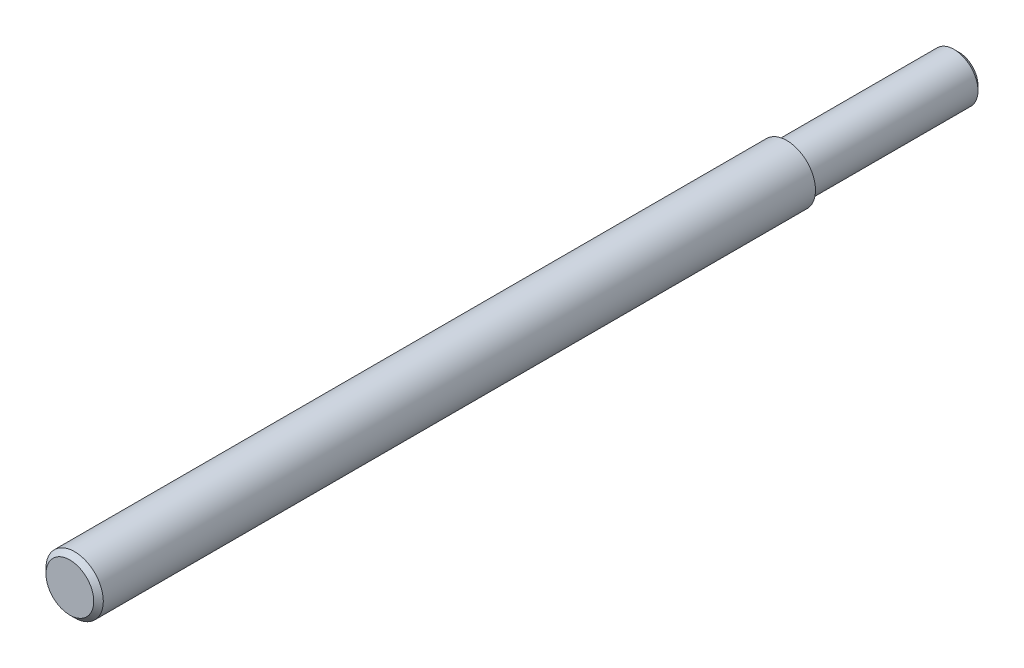
ISO-10303-21;
HEADER;
FILE_DESCRIPTION(('STEP AP214'),'2;1');
FILE_NAME('part.step','',(''),(''),'','','');
FILE_SCHEMA(('AUTOMOTIVE_DESIGN { 1 0 10303 214 1 1 1 1 }'));
ENDSEC;
DATA;
#1=APPLICATION_CONTEXT('core data for automotive mechanical design processes');
#2=APPLICATION_PROTOCOL_DEFINITION('international standard','automotive_design',2000,#1);
#3=PRODUCT_CONTEXT('',#1,'mechanical');
#4=PRODUCT('Part','Part','',(#3));
#5=PRODUCT_RELATED_PRODUCT_CATEGORY('part','',(#4));
#6=PRODUCT_DEFINITION_FORMATION('','',#4);
#7=PRODUCT_DEFINITION_CONTEXT('part definition',#1,'design');
#8=PRODUCT_DEFINITION('design','',#6,#7);
#9=PRODUCT_DEFINITION_SHAPE('','',#8);
#10=(LENGTH_UNIT() NAMED_UNIT(*) SI_UNIT(.MILLI.,.METRE.));
#11=(NAMED_UNIT(*) PLANE_ANGLE_UNIT() SI_UNIT($,.RADIAN.));
#12=(NAMED_UNIT(*) SI_UNIT($,.STERADIAN.) SOLID_ANGLE_UNIT());
#13=UNCERTAINTY_MEASURE_WITH_UNIT(LENGTH_MEASURE(1.E-05),#10,'distance_accuracy_value','');
#14=(GEOMETRIC_REPRESENTATION_CONTEXT(3) GLOBAL_UNCERTAINTY_ASSIGNED_CONTEXT((#13)) GLOBAL_UNIT_ASSIGNED_CONTEXT((#10,
#11,#12)) REPRESENTATION_CONTEXT('',''));
#15=CARTESIAN_POINT('',(0.,0.,0.));
#16=DIRECTION('',(0.,0.,1.));
#17=DIRECTION('',(1.,0.,0.));
#18=AXIS2_PLACEMENT_3D('',#15,#16,#17);
#19=CARTESIAN_POINT('',(0.,0.,36.));
#20=DIRECTION('',(0.,0.,-1.));
#21=DIRECTION('',(-1.,0.,0.));
#22=AXIS2_PLACEMENT_3D('',#19,#20,#21);
#23=CYLINDRICAL_SURFACE('',#22,5.);
#24=CARTESIAN_POINT('',(0.,0.,1.00000000000001));
#25=DIRECTION('',(0.,0.,1.));
#26=DIRECTION('',(1.,0.,0.));
#27=AXIS2_PLACEMENT_3D('',#24,#25,#26);
#28=CIRCLE('',#27,5.);
#29=CARTESIAN_POINT('',(5.,0.,1.00000000000001));
#30=VERTEX_POINT('',#29);
#31=EDGE_CURVE('E38',#30,#30,#28,.T.);
#32=ORIENTED_EDGE('',*,*,#31,.T.);
#33=EDGE_LOOP('',(#32));
#34=FACE_BOUND('',#33,.T.);
#35=CARTESIAN_POINT('',(0.,0.,36.));
#36=DIRECTION('',(0.,0.,1.));
#37=DIRECTION('',(1.,0.,0.));
#38=AXIS2_PLACEMENT_3D('',#35,#36,#37);
#39=CIRCLE('',#38,5.);
#40=CARTESIAN_POINT('',(5.,0.,36.));
#41=VERTEX_POINT('',#40);
#42=EDGE_CURVE('E51',#41,#41,#39,.T.);
#43=ORIENTED_EDGE('',*,*,#42,.F.);
#44=EDGE_LOOP('',(#43));
#45=FACE_BOUND('',#44,.T.);
#46=ADVANCED_FACE('F31',(#34,#45),#23,.T.);
#47=CARTESIAN_POINT('',(0.,0.,0.));
#48=DIRECTION('',(0.,0.,1.));
#49=DIRECTION('',(1.,0.,0.));
#50=AXIS2_PLACEMENT_3D('',#47,#48,#49);
#51=PLANE('',#50);
#52=CARTESIAN_POINT('',(0.,0.,0.));
#53=DIRECTION('',(0.,0.,1.));
#54=DIRECTION('',(1.,0.,0.));
#55=AXIS2_PLACEMENT_3D('',#52,#53,#54);
#56=CIRCLE('',#55,3.99999999999998);
#57=CARTESIAN_POINT('',(3.99999999999998,0.,0.));
#58=VERTEX_POINT('',#57);
#59=EDGE_CURVE('E10',#58,#58,#56,.F.);
#60=ORIENTED_EDGE('',*,*,#59,.T.);
#61=EDGE_LOOP('',(#60));
#62=FACE_BOUND('',#61,.T.);
#63=ADVANCED_FACE('F75',(#62),#51,.F.);
#64=CARTESIAN_POINT('',(0.,0.,186.));
#65=DIRECTION('',(0.,0.,-1.));
#66=DIRECTION('',(-1.,0.,0.));
#67=AXIS2_PLACEMENT_3D('',#64,#65,#66);
#68=CYLINDRICAL_SURFACE('',#67,6.);
#69=CARTESIAN_POINT('',(0.,0.,185.));
#70=DIRECTION('',(0.,0.,1.));
#71=DIRECTION('',(1.,0.,0.));
#72=AXIS2_PLACEMENT_3D('',#69,#70,#71);
#73=CIRCLE('',#72,6.);
#74=CARTESIAN_POINT('',(6.,0.,185.));
#75=VERTEX_POINT('',#74);
#76=EDGE_CURVE('E42',#75,#75,#73,.F.);
#77=ORIENTED_EDGE('',*,*,#76,.T.);
#78=EDGE_LOOP('',(#77));
#79=FACE_BOUND('',#78,.T.);
#80=CARTESIAN_POINT('',(0.,0.,36.));
#81=DIRECTION('',(0.,0.,1.));
#82=DIRECTION('',(1.,0.,0.));
#83=AXIS2_PLACEMENT_3D('',#80,#81,#82);
#84=CIRCLE('',#83,6.);
#85=CARTESIAN_POINT('',(6.,0.,36.));
#86=VERTEX_POINT('',#85);
#87=EDGE_CURVE('E54',#86,#86,#84,.T.);
#88=ORIENTED_EDGE('',*,*,#87,.T.);
#89=EDGE_LOOP('',(#88));
#90=FACE_BOUND('',#89,.T.);
#91=ADVANCED_FACE('F58',(#79,#90),#68,.T.);
#92=CARTESIAN_POINT('',(0.,0.,186.));
#93=DIRECTION('',(0.,0.,1.));
#94=DIRECTION('',(1.,0.,0.));
#95=AXIS2_PLACEMENT_3D('',#92,#93,#94);
#96=PLANE('',#95);
#97=CARTESIAN_POINT('',(0.,0.,186.));
#98=DIRECTION('',(0.,0.,1.));
#99=DIRECTION('',(1.,0.,0.));
#100=AXIS2_PLACEMENT_3D('',#97,#98,#99);
#101=CIRCLE('',#100,5.);
#102=CARTESIAN_POINT('',(5.,0.,186.));
#103=VERTEX_POINT('',#102);
#104=EDGE_CURVE('E46',#103,#103,#101,.T.);
#105=ORIENTED_EDGE('',*,*,#104,.T.);
#106=EDGE_LOOP('',(#105));
#107=FACE_BOUND('',#106,.T.);
#108=ADVANCED_FACE('F63',(#107),#96,.T.);
#109=CARTESIAN_POINT('',(0.,0.,36.));
#110=DIRECTION('',(0.,0.,1.));
#111=DIRECTION('',(1.,0.,0.));
#112=AXIS2_PLACEMENT_3D('',#109,#110,#111);
#113=PLANE('',#112);
#114=ORIENTED_EDGE('',*,*,#42,.T.);
#115=EDGE_LOOP('',(#114));
#116=FACE_BOUND('',#115,.T.);
#117=ORIENTED_EDGE('',*,*,#87,.F.);
#118=EDGE_LOOP('',(#117));
#119=FACE_BOUND('',#118,.T.);
#120=ADVANCED_FACE('F60',(#116,#119),#113,.F.);
#121=CARTESIAN_POINT('',(0.,0.,186.));
#122=DIRECTION('',(0.,0.,-1.));
#123=DIRECTION('',(-1.,0.,0.));
#124=AXIS2_PLACEMENT_3D('',#121,#122,#123);
#125=CONICAL_SURFACE('',#124,5.,0.785398163397446);
#126=ORIENTED_EDGE('',*,*,#76,.F.);
#127=EDGE_LOOP('',(#126));
#128=FACE_BOUND('',#127,.T.);
#129=ORIENTED_EDGE('',*,*,#104,.F.);
#130=EDGE_LOOP('',(#129));
#131=FACE_BOUND('',#130,.T.);
#132=ADVANCED_FACE('F62',(#128,#131),#125,.T.);
#133=CARTESIAN_POINT('',(0.,0.,1.00000000000001));
#134=DIRECTION('',(0.,0.,1.));
#135=DIRECTION('',(1.,0.,0.));
#136=AXIS2_PLACEMENT_3D('',#133,#134,#135);
#137=CONICAL_SURFACE('',#136,5.,0.785398163397456);
#138=ORIENTED_EDGE('',*,*,#59,.F.);
#139=EDGE_LOOP('',(#138));
#140=FACE_BOUND('',#139,.T.);
#141=ORIENTED_EDGE('',*,*,#31,.F.);
#142=EDGE_LOOP('',(#141));
#143=FACE_BOUND('',#142,.T.);
#144=ADVANCED_FACE('F33',(#140,#143),#137,.T.);
#145=CLOSED_SHELL('',(#46,#63,#91,#108,#120,#132,#144));
#146=MANIFOLD_SOLID_BREP('B2',#145);
#147=ADVANCED_BREP_SHAPE_REPRESENTATION('',(#18,#146),#14);
#148=SHAPE_DEFINITION_REPRESENTATION(#9,#147);
ENDSEC;
END-ISO-10303-21;
